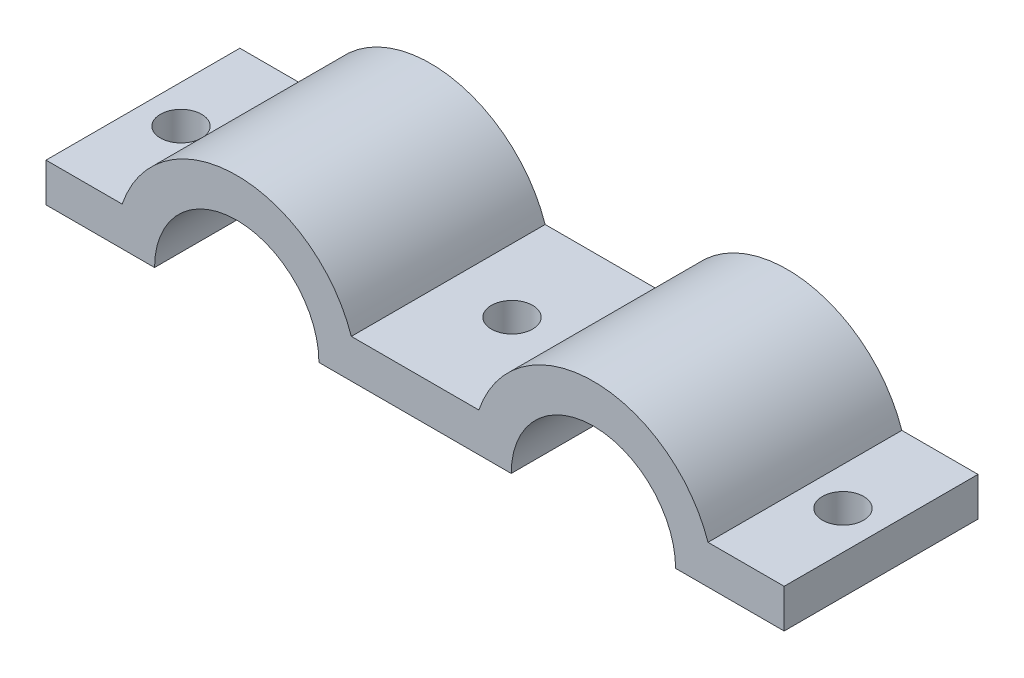
ISO-10303-21;
HEADER;
FILE_DESCRIPTION(('STEP AP214'),'2;1');
FILE_NAME('part.step','',(''),(''),'','','');
FILE_SCHEMA(('AUTOMOTIVE_DESIGN { 1 0 10303 214 1 1 1 1 }'));
ENDSEC;
DATA;
#1=APPLICATION_CONTEXT('core data for automotive mechanical design processes');
#2=APPLICATION_PROTOCOL_DEFINITION('international standard','automotive_design',2000,#1);
#3=PRODUCT_CONTEXT('',#1,'mechanical');
#4=PRODUCT('Part','Part','',(#3));
#5=PRODUCT_RELATED_PRODUCT_CATEGORY('part','',(#4));
#6=PRODUCT_DEFINITION_FORMATION('','',#4);
#7=PRODUCT_DEFINITION_CONTEXT('part definition',#1,'design');
#8=PRODUCT_DEFINITION('design','',#6,#7);
#9=PRODUCT_DEFINITION_SHAPE('','',#8);
#10=(LENGTH_UNIT() NAMED_UNIT(*) SI_UNIT(.MILLI.,.METRE.));
#11=(NAMED_UNIT(*) PLANE_ANGLE_UNIT() SI_UNIT($,.RADIAN.));
#12=(NAMED_UNIT(*) SI_UNIT($,.STERADIAN.) SOLID_ANGLE_UNIT());
#13=UNCERTAINTY_MEASURE_WITH_UNIT(LENGTH_MEASURE(1.E-05),#10,'distance_accuracy_value','');
#14=(GEOMETRIC_REPRESENTATION_CONTEXT(3) GLOBAL_UNCERTAINTY_ASSIGNED_CONTEXT((#13)) GLOBAL_UNIT_ASSIGNED_CONTEXT((#10,
#11,#12)) REPRESENTATION_CONTEXT('',''));
#15=CARTESIAN_POINT('',(0.,0.,0.));
#16=DIRECTION('',(0.,0.,1.));
#17=DIRECTION('',(1.,0.,0.));
#18=AXIS2_PLACEMENT_3D('',#15,#16,#17);
#19=CARTESIAN_POINT('',(31.242,-2.20309881449055E-13,31.75));
#20=DIRECTION('',(0.,0.,-1.));
#21=DIRECTION('',(-1.,0.,0.));
#22=AXIS2_PLACEMENT_3D('',#19,#20,#21);
#23=CYLINDRICAL_SURFACE('',#22,19.8120000001747);
#24=CARTESIAN_POINT('',(31.242,-2.20309881449055E-13,0.));
#25=DIRECTION('',(0.,0.,1.));
#26=DIRECTION('',(-1.,0.,0.));
#27=AXIS2_PLACEMENT_3D('',#24,#25,#26);
#28=CIRCLE('',#27,19.8120000001747);
#29=CARTESIAN_POINT('',(50.0088016456433,6.35,0.));
#30=VERTEX_POINT('',#29);
#31=CARTESIAN_POINT('',(12.4751983543567,6.35,0.));
#32=VERTEX_POINT('',#31);
#33=EDGE_CURVE('E157',#30,#32,#28,.T.);
#34=ORIENTED_EDGE('',*,*,#33,.T.);
#35=DIRECTION('',(0.,0.,-1.));
#36=VECTOR('',#35,1.);
#37=CARTESIAN_POINT('',(12.4751983543567,6.35,31.75));
#38=LINE('',#37,#36);
#39=CARTESIAN_POINT('',(12.4751983543567,6.35,31.75));
#40=VERTEX_POINT('',#39);
#41=EDGE_CURVE('E11',#40,#32,#38,.T.);
#42=ORIENTED_EDGE('',*,*,#41,.F.);
#43=CARTESIAN_POINT('',(31.242,-2.20309881449055E-13,31.75));
#44=DIRECTION('',(0.,0.,1.));
#45=DIRECTION('',(-1.,0.,0.));
#46=AXIS2_PLACEMENT_3D('',#43,#44,#45);
#47=CIRCLE('',#46,19.8120000001747);
#48=CARTESIAN_POINT('',(50.0088016456433,6.35,31.75));
#49=VERTEX_POINT('',#48);
#50=EDGE_CURVE('E180',#49,#40,#47,.T.);
#51=ORIENTED_EDGE('',*,*,#50,.F.);
#52=DIRECTION('',(0.,0.,-1.));
#53=VECTOR('',#52,1.);
#54=CARTESIAN_POINT('',(50.0088016456433,6.35,31.75));
#55=LINE('',#54,#53);
#56=EDGE_CURVE('E153',#49,#30,#55,.T.);
#57=ORIENTED_EDGE('',*,*,#56,.T.);
#58=EDGE_LOOP('',(#34,#42,#51,#57));
#59=FACE_BOUND('',#58,.T.);
#60=ADVANCED_FACE('F37',(#59),#23,.T.);
#61=CARTESIAN_POINT('',(12.4751983543567,6.35,31.75));
#62=DIRECTION('',(0.,-1.,0.));
#63=DIRECTION('',(1.,0.,0.));
#64=AXIS2_PLACEMENT_3D('',#61,#62,#63);
#65=PLANE('',#64);
#66=CARTESIAN_POINT('',(6.23759917717834,6.35,15.875));
#67=DIRECTION('',(0.,1.,0.));
#68=DIRECTION('',(-1.,0.,0.));
#69=AXIS2_PLACEMENT_3D('',#66,#67,#68);
#70=CIRCLE('',#69,3.37819999999999);
#71=CARTESIAN_POINT('',(2.85939917717835,6.35,15.875));
#72=VERTEX_POINT('',#71);
#73=EDGE_CURVE('E301',#72,#72,#70,.T.);
#74=ORIENTED_EDGE('',*,*,#73,.F.);
#75=EDGE_LOOP('',(#74));
#76=FACE_BOUND('',#75,.T.);
#77=DIRECTION('',(-1.,0.,0.));
#78=VECTOR('',#77,1.);
#79=CARTESIAN_POINT('',(12.4751983543567,6.35,0.));
#80=LINE('',#79,#78);
#81=CARTESIAN_POINT('',(0.,6.35,0.));
#82=VERTEX_POINT('',#81);
#83=EDGE_CURVE('E160',#32,#82,#80,.T.);
#84=ORIENTED_EDGE('',*,*,#83,.T.);
#85=DIRECTION('',(0.,0.,-1.));
#86=VECTOR('',#85,1.);
#87=CARTESIAN_POINT('',(0.,6.35,31.75));
#88=LINE('',#87,#86);
#89=CARTESIAN_POINT('',(0.,6.35,31.75));
#90=VERTEX_POINT('',#89);
#91=EDGE_CURVE('E45',#90,#82,#88,.T.);
#92=ORIENTED_EDGE('',*,*,#91,.F.);
#93=DIRECTION('',(-1.,0.,0.));
#94=VECTOR('',#93,1.);
#95=CARTESIAN_POINT('',(12.4751983543567,6.35,31.75));
#96=LINE('',#95,#94);
#97=EDGE_CURVE('E108',#40,#90,#96,.T.);
#98=ORIENTED_EDGE('',*,*,#97,.F.);
#99=ORIENTED_EDGE('',*,*,#41,.T.);
#100=EDGE_LOOP('',(#84,#92,#98,#99));
#101=FACE_BOUND('',#100,.T.);
#102=ADVANCED_FACE('F260',(#76,#101),#65,.F.);
#103=CARTESIAN_POINT('',(0.,6.35,31.75));
#104=DIRECTION('',(1.,0.,0.));
#105=DIRECTION('',(0.,1.,0.));
#106=AXIS2_PLACEMENT_3D('',#103,#104,#105);
#107=PLANE('',#106);
#108=DIRECTION('',(0.,-1.,0.));
#109=VECTOR('',#108,1.);
#110=CARTESIAN_POINT('',(0.,6.35,0.));
#111=LINE('',#110,#109);
#112=CARTESIAN_POINT('',(0.,0.,0.));
#113=VERTEX_POINT('',#112);
#114=EDGE_CURVE('E163',#82,#113,#111,.T.);
#115=ORIENTED_EDGE('',*,*,#114,.T.);
#116=DIRECTION('',(0.,0.,-1.));
#117=VECTOR('',#116,1.);
#118=CARTESIAN_POINT('',(0.,0.,31.75));
#119=LINE('',#118,#117);
#120=CARTESIAN_POINT('',(0.,0.,31.75));
#121=VERTEX_POINT('',#120);
#122=EDGE_CURVE('E199',#121,#113,#119,.T.);
#123=ORIENTED_EDGE('',*,*,#122,.F.);
#124=DIRECTION('',(0.,-1.,0.));
#125=VECTOR('',#124,1.);
#126=CARTESIAN_POINT('',(0.,6.35,31.75));
#127=LINE('',#126,#125);
#128=EDGE_CURVE('E207',#90,#121,#127,.T.);
#129=ORIENTED_EDGE('',*,*,#128,.F.);
#130=ORIENTED_EDGE('',*,*,#91,.T.);
#131=EDGE_LOOP('',(#115,#123,#129,#130));
#132=FACE_BOUND('',#131,.T.);
#133=ADVANCED_FACE('F205',(#132),#107,.F.);
#134=CARTESIAN_POINT('',(0.,0.,31.75));
#135=DIRECTION('',(0.,1.,0.));
#136=DIRECTION('',(0.,0.,1.));
#137=AXIS2_PLACEMENT_3D('',#134,#135,#136);
#138=PLANE('',#137);
#139=CARTESIAN_POINT('',(6.23759917717835,0.,15.875));
#140=DIRECTION('',(0.,1.,0.));
#141=DIRECTION('',(-1.,0.,0.));
#142=AXIS2_PLACEMENT_3D('',#139,#140,#141);
#143=CIRCLE('',#142,3.37819999999999);
#144=CARTESIAN_POINT('',(2.85939917717835,0.,15.875));
#145=VERTEX_POINT('',#144);
#146=EDGE_CURVE('E297',#145,#145,#143,.T.);
#147=ORIENTED_EDGE('',*,*,#146,.T.);
#148=EDGE_LOOP('',(#147));
#149=FACE_BOUND('',#148,.T.);
#150=DIRECTION('',(1.,0.,0.));
#151=VECTOR('',#150,1.);
#152=CARTESIAN_POINT('',(0.,0.,0.));
#153=LINE('',#152,#151);
#154=CARTESIAN_POINT('',(17.78,0.,0.));
#155=VERTEX_POINT('',#154);
#156=EDGE_CURVE('E165',#113,#155,#153,.T.);
#157=ORIENTED_EDGE('',*,*,#156,.T.);
#158=DIRECTION('',(0.,0.,-1.));
#159=VECTOR('',#158,1.);
#160=CARTESIAN_POINT('',(17.78,0.,31.75));
#161=LINE('',#160,#159);
#162=CARTESIAN_POINT('',(17.78,0.,31.75));
#163=VERTEX_POINT('',#162);
#164=EDGE_CURVE('E196',#163,#155,#161,.T.);
#165=ORIENTED_EDGE('',*,*,#164,.F.);
#166=DIRECTION('',(1.,0.,0.));
#167=VECTOR('',#166,1.);
#168=CARTESIAN_POINT('',(0.,0.,31.75));
#169=LINE('',#168,#167);
#170=EDGE_CURVE('E225',#121,#163,#169,.T.);
#171=ORIENTED_EDGE('',*,*,#170,.F.);
#172=ORIENTED_EDGE('',*,*,#122,.T.);
#173=EDGE_LOOP('',(#157,#165,#171,#172));
#174=FACE_BOUND('',#173,.T.);
#175=ADVANCED_FACE('F216',(#149,#174),#138,.F.);
#176=CARTESIAN_POINT('',(31.242,-2.20309881449055E-13,31.75));
#177=DIRECTION('',(0.,0.,-1.));
#178=DIRECTION('',(-1.,0.,0.));
#179=AXIS2_PLACEMENT_3D('',#176,#177,#178);
#180=CYLINDRICAL_SURFACE('',#179,13.462);
#181=CARTESIAN_POINT('',(31.242,-2.20309881449055E-13,0.));
#182=DIRECTION('',(0.,0.,-1.));
#183=DIRECTION('',(-1.,0.,0.));
#184=AXIS2_PLACEMENT_3D('',#181,#182,#183);
#185=CIRCLE('',#184,13.462);
#186=CARTESIAN_POINT('',(44.704,0.,0.));
#187=VERTEX_POINT('',#186);
#188=EDGE_CURVE('E167',#155,#187,#185,.T.);
#189=ORIENTED_EDGE('',*,*,#188,.T.);
#190=DIRECTION('',(0.,0.,-1.));
#191=VECTOR('',#190,1.);
#192=CARTESIAN_POINT('',(44.704,0.,31.75));
#193=LINE('',#192,#191);
#194=CARTESIAN_POINT('',(44.704,0.,31.75));
#195=VERTEX_POINT('',#194);
#196=EDGE_CURVE('E193',#195,#187,#193,.T.);
#197=ORIENTED_EDGE('',*,*,#196,.F.);
#198=CARTESIAN_POINT('',(31.242,-2.20309881449055E-13,31.75));
#199=DIRECTION('',(0.,0.,-1.));
#200=DIRECTION('',(-1.,0.,0.));
#201=AXIS2_PLACEMENT_3D('',#198,#199,#200);
#202=CIRCLE('',#201,13.462);
#203=EDGE_CURVE('E222',#163,#195,#202,.T.);
#204=ORIENTED_EDGE('',*,*,#203,.F.);
#205=ORIENTED_EDGE('',*,*,#164,.T.);
#206=EDGE_LOOP('',(#189,#197,#204,#205));
#207=FACE_BOUND('',#206,.T.);
#208=ADVANCED_FACE('F220',(#207),#180,.F.);
#209=CARTESIAN_POINT('',(76.2,0.,31.75));
#210=DIRECTION('',(0.,1.,0.));
#211=DIRECTION('',(-1.,0.,0.));
#212=AXIS2_PLACEMENT_3D('',#209,#210,#211);
#213=PLANE('',#212);
#214=CARTESIAN_POINT('',(60.452,0.,15.875));
#215=DIRECTION('',(0.,1.,0.));
#216=DIRECTION('',(-1.,0.,0.));
#217=AXIS2_PLACEMENT_3D('',#214,#215,#216);
#218=CIRCLE('',#217,3.37819999999998);
#219=CARTESIAN_POINT('',(57.0738,0.,15.875));
#220=VERTEX_POINT('',#219);
#221=EDGE_CURVE('E161',#220,#220,#218,.T.);
#222=ORIENTED_EDGE('',*,*,#221,.T.);
#223=EDGE_LOOP('',(#222));
#224=FACE_BOUND('',#223,.T.);
#225=DIRECTION('',(1.,0.,0.));
#226=VECTOR('',#225,1.);
#227=CARTESIAN_POINT('',(76.2,0.,0.));
#228=LINE('',#227,#226);
#229=CARTESIAN_POINT('',(76.1999999999999,0.,0.));
#230=VERTEX_POINT('',#229);
#231=EDGE_CURVE('E169',#187,#230,#228,.T.);
#232=ORIENTED_EDGE('',*,*,#231,.T.);
#233=DIRECTION('',(0.,0.,-1.));
#234=VECTOR('',#233,1.);
#235=CARTESIAN_POINT('',(76.1999999999999,0.,31.75));
#236=LINE('',#235,#234);
#237=CARTESIAN_POINT('',(76.1999999999999,0.,31.75));
#238=VERTEX_POINT('',#237);
#239=EDGE_CURVE('E190',#238,#230,#236,.T.);
#240=ORIENTED_EDGE('',*,*,#239,.F.);
#241=DIRECTION('',(1.,0.,0.));
#242=VECTOR('',#241,1.);
#243=CARTESIAN_POINT('',(76.2,0.,31.75));
#244=LINE('',#243,#242);
#245=EDGE_CURVE('E224',#195,#238,#244,.T.);
#246=ORIENTED_EDGE('',*,*,#245,.F.);
#247=ORIENTED_EDGE('',*,*,#196,.T.);
#248=EDGE_LOOP('',(#232,#240,#246,#247));
#249=FACE_BOUND('',#248,.T.);
#250=ADVANCED_FACE('F276',(#224,#249),#213,.F.);
#251=CARTESIAN_POINT('',(89.662,-2.13155494848436E-13,31.75));
#252=DIRECTION('',(0.,0.,-1.));
#253=DIRECTION('',(-1.,0.,0.));
#254=AXIS2_PLACEMENT_3D('',#251,#252,#253);
#255=CYLINDRICAL_SURFACE('',#254,13.462);
#256=CARTESIAN_POINT('',(89.662,-2.13155494848436E-13,0.));
#257=DIRECTION('',(0.,0.,-1.));
#258=DIRECTION('',(1.,0.,0.));
#259=AXIS2_PLACEMENT_3D('',#256,#257,#258);
#260=CIRCLE('',#259,13.462);
#261=CARTESIAN_POINT('',(103.124,0.,0.));
#262=VERTEX_POINT('',#261);
#263=EDGE_CURVE('E171',#230,#262,#260,.T.);
#264=ORIENTED_EDGE('',*,*,#263,.T.);
#265=DIRECTION('',(0.,0.,-1.));
#266=VECTOR('',#265,1.);
#267=CARTESIAN_POINT('',(103.124,0.,31.75));
#268=LINE('',#267,#266);
#269=CARTESIAN_POINT('',(103.124,0.,31.75));
#270=VERTEX_POINT('',#269);
#271=EDGE_CURVE('E187',#270,#262,#268,.T.);
#272=ORIENTED_EDGE('',*,*,#271,.F.);
#273=CARTESIAN_POINT('',(89.662,-2.13155494848436E-13,31.75));
#274=DIRECTION('',(0.,0.,-1.));
#275=DIRECTION('',(1.,0.,0.));
#276=AXIS2_PLACEMENT_3D('',#273,#274,#275);
#277=CIRCLE('',#276,13.462);
#278=EDGE_CURVE('E227',#238,#270,#277,.T.);
#279=ORIENTED_EDGE('',*,*,#278,.F.);
#280=ORIENTED_EDGE('',*,*,#239,.T.);
#281=EDGE_LOOP('',(#264,#272,#279,#280));
#282=FACE_BOUND('',#281,.T.);
#283=ADVANCED_FACE('F279',(#282),#255,.F.);
#284=CARTESIAN_POINT('',(120.904,0.,31.75));
#285=DIRECTION('',(0.,1.,0.));
#286=DIRECTION('',(-1.,0.,0.));
#287=AXIS2_PLACEMENT_3D('',#284,#285,#286);
#288=PLANE('',#287);
#289=CARTESIAN_POINT('',(114.666400822822,0.,15.875));
#290=DIRECTION('',(0.,-1.,0.));
#291=DIRECTION('',(1.,0.,0.));
#292=AXIS2_PLACEMENT_3D('',#289,#290,#291);
#293=CIRCLE('',#292,3.37819999999999);
#294=CARTESIAN_POINT('',(118.044600822822,0.,15.875));
#295=VERTEX_POINT('',#294);
#296=EDGE_CURVE('E298',#295,#295,#293,.T.);
#297=ORIENTED_EDGE('',*,*,#296,.F.);
#298=EDGE_LOOP('',(#297));
#299=FACE_BOUND('',#298,.T.);
#300=DIRECTION('',(1.,0.,0.));
#301=VECTOR('',#300,1.);
#302=CARTESIAN_POINT('',(120.904,0.,0.));
#303=LINE('',#302,#301);
#304=CARTESIAN_POINT('',(120.904,0.,0.));
#305=VERTEX_POINT('',#304);
#306=EDGE_CURVE('E173',#262,#305,#303,.T.);
#307=ORIENTED_EDGE('',*,*,#306,.T.);
#308=DIRECTION('',(0.,0.,-1.));
#309=VECTOR('',#308,1.);
#310=CARTESIAN_POINT('',(120.904,0.,31.75));
#311=LINE('',#310,#309);
#312=CARTESIAN_POINT('',(120.904,0.,31.75));
#313=VERTEX_POINT('',#312);
#314=EDGE_CURVE('E184',#313,#305,#311,.T.);
#315=ORIENTED_EDGE('',*,*,#314,.F.);
#316=DIRECTION('',(1.,0.,0.));
#317=VECTOR('',#316,1.);
#318=CARTESIAN_POINT('',(120.904,0.,31.75));
#319=LINE('',#318,#317);
#320=EDGE_CURVE('E233',#270,#313,#319,.T.);
#321=ORIENTED_EDGE('',*,*,#320,.F.);
#322=ORIENTED_EDGE('',*,*,#271,.T.);
#323=EDGE_LOOP('',(#307,#315,#321,#322));
#324=FACE_BOUND('',#323,.T.);
#325=ADVANCED_FACE('F239',(#299,#324),#288,.F.);
#326=CARTESIAN_POINT('',(120.904,6.35000000000001,31.75));
#327=DIRECTION('',(-1.,0.,0.));
#328=DIRECTION('',(0.,-1.,0.));
#329=AXIS2_PLACEMENT_3D('',#326,#327,#328);
#330=PLANE('',#329);
#331=DIRECTION('',(0.,1.,0.));
#332=VECTOR('',#331,1.);
#333=CARTESIAN_POINT('',(120.904,6.35000000000001,0.));
#334=LINE('',#333,#332);
#335=CARTESIAN_POINT('',(120.904,6.35000000000001,0.));
#336=VERTEX_POINT('',#335);
#337=EDGE_CURVE('E175',#305,#336,#334,.T.);
#338=ORIENTED_EDGE('',*,*,#337,.T.);
#339=DIRECTION('',(0.,0.,-1.));
#340=VECTOR('',#339,1.);
#341=CARTESIAN_POINT('',(120.904,6.35000000000001,31.75));
#342=LINE('',#341,#340);
#343=CARTESIAN_POINT('',(120.904,6.35000000000001,31.75));
#344=VERTEX_POINT('',#343);
#345=EDGE_CURVE('E148',#344,#336,#342,.T.);
#346=ORIENTED_EDGE('',*,*,#345,.F.);
#347=DIRECTION('',(0.,1.,0.));
#348=VECTOR('',#347,1.);
#349=CARTESIAN_POINT('',(120.904,6.35000000000001,31.75));
#350=LINE('',#349,#348);
#351=EDGE_CURVE('E139',#313,#344,#350,.T.);
#352=ORIENTED_EDGE('',*,*,#351,.F.);
#353=ORIENTED_EDGE('',*,*,#314,.T.);
#354=EDGE_LOOP('',(#338,#346,#352,#353));
#355=FACE_BOUND('',#354,.T.);
#356=ADVANCED_FACE('F243',(#355),#330,.F.);
#357=CARTESIAN_POINT('',(108.428801645643,6.35000000000001,31.75));
#358=DIRECTION('',(0.,-1.,0.));
#359=DIRECTION('',(1.,0.,0.));
#360=AXIS2_PLACEMENT_3D('',#357,#358,#359);
#361=PLANE('',#360);
#362=CARTESIAN_POINT('',(114.666400822822,6.35000000000001,15.875));
#363=DIRECTION('',(0.,-1.,0.));
#364=DIRECTION('',(1.,0.,0.));
#365=AXIS2_PLACEMENT_3D('',#362,#363,#364);
#366=CIRCLE('',#365,3.37819999999999);
#367=CARTESIAN_POINT('',(118.044600822822,6.35000000000002,15.875));
#368=VERTEX_POINT('',#367);
#369=EDGE_CURVE('E295',#368,#368,#366,.T.);
#370=ORIENTED_EDGE('',*,*,#369,.T.);
#371=EDGE_LOOP('',(#370));
#372=FACE_BOUND('',#371,.T.);
#373=DIRECTION('',(-1.,0.,0.));
#374=VECTOR('',#373,1.);
#375=CARTESIAN_POINT('',(108.428801645643,6.35000000000001,0.));
#376=LINE('',#375,#374);
#377=CARTESIAN_POINT('',(108.428801645643,6.35000000000001,0.));
#378=VERTEX_POINT('',#377);
#379=EDGE_CURVE('E147',#336,#378,#376,.T.);
#380=ORIENTED_EDGE('',*,*,#379,.T.);
#381=DIRECTION('',(0.,0.,-1.));
#382=VECTOR('',#381,1.);
#383=CARTESIAN_POINT('',(108.428801645643,6.35000000000001,31.75));
#384=LINE('',#383,#382);
#385=CARTESIAN_POINT('',(108.428801645643,6.35000000000001,31.75));
#386=VERTEX_POINT('',#385);
#387=EDGE_CURVE('E144',#386,#378,#384,.T.);
#388=ORIENTED_EDGE('',*,*,#387,.F.);
#389=DIRECTION('',(-1.,0.,0.));
#390=VECTOR('',#389,1.);
#391=CARTESIAN_POINT('',(108.428801645643,6.35000000000001,31.75));
#392=LINE('',#391,#390);
#393=EDGE_CURVE('E133',#344,#386,#392,.T.);
#394=ORIENTED_EDGE('',*,*,#393,.F.);
#395=ORIENTED_EDGE('',*,*,#345,.T.);
#396=EDGE_LOOP('',(#380,#388,#394,#395));
#397=FACE_BOUND('',#396,.T.);
#398=ADVANCED_FACE('F145',(#372,#397),#361,.F.);
#399=CARTESIAN_POINT('',(89.662,-2.13155494848436E-13,31.75));
#400=DIRECTION('',(0.,0.,-1.));
#401=DIRECTION('',(-1.,0.,0.));
#402=AXIS2_PLACEMENT_3D('',#399,#400,#401);
#403=CYLINDRICAL_SURFACE('',#402,19.8120000001747);
#404=CARTESIAN_POINT('',(89.662,-2.13155494848436E-13,0.));
#405=DIRECTION('',(0.,0.,1.));
#406=DIRECTION('',(1.,0.,0.));
#407=AXIS2_PLACEMENT_3D('',#404,#405,#406);
#408=CIRCLE('',#407,19.8120000001747);
#409=CARTESIAN_POINT('',(70.8951983543567,6.35,0.));
#410=VERTEX_POINT('',#409);
#411=EDGE_CURVE('E94',#378,#410,#408,.T.);
#412=ORIENTED_EDGE('',*,*,#411,.T.);
#413=DIRECTION('',(0.,0.,-1.));
#414=VECTOR('',#413,1.);
#415=CARTESIAN_POINT('',(70.8951983543567,6.35,31.75));
#416=LINE('',#415,#414);
#417=CARTESIAN_POINT('',(70.8951983543567,6.35,31.75));
#418=VERTEX_POINT('',#417);
#419=EDGE_CURVE('E149',#418,#410,#416,.T.);
#420=ORIENTED_EDGE('',*,*,#419,.F.);
#421=CARTESIAN_POINT('',(89.662,-2.13155494848436E-13,31.75));
#422=DIRECTION('',(0.,0.,1.));
#423=DIRECTION('',(1.,0.,0.));
#424=AXIS2_PLACEMENT_3D('',#421,#422,#423);
#425=CIRCLE('',#424,19.8120000001747);
#426=EDGE_CURVE('E137',#386,#418,#425,.T.);
#427=ORIENTED_EDGE('',*,*,#426,.F.);
#428=ORIENTED_EDGE('',*,*,#387,.T.);
#429=EDGE_LOOP('',(#412,#420,#427,#428));
#430=FACE_BOUND('',#429,.T.);
#431=ADVANCED_FACE('F151',(#430),#403,.T.);
#432=CARTESIAN_POINT('',(50.0088016456433,6.35,31.75));
#433=DIRECTION('',(0.,-1.,0.));
#434=DIRECTION('',(1.,0.,0.));
#435=AXIS2_PLACEMENT_3D('',#432,#433,#434);
#436=PLANE('',#435);
#437=CARTESIAN_POINT('',(60.452,6.35000000000001,15.875));
#438=DIRECTION('',(0.,1.,0.));
#439=DIRECTION('',(-1.,0.,0.));
#440=AXIS2_PLACEMENT_3D('',#437,#438,#439);
#441=CIRCLE('',#440,3.37819999999998);
#442=CARTESIAN_POINT('',(57.0738,6.35000000000001,15.875));
#443=VERTEX_POINT('',#442);
#444=EDGE_CURVE('E309',#443,#443,#441,.T.);
#445=ORIENTED_EDGE('',*,*,#444,.F.);
#446=EDGE_LOOP('',(#445));
#447=FACE_BOUND('',#446,.T.);
#448=DIRECTION('',(-1.,0.,0.));
#449=VECTOR('',#448,1.);
#450=CARTESIAN_POINT('',(50.0088016456433,6.35,0.));
#451=LINE('',#450,#449);
#452=EDGE_CURVE('E100',#410,#30,#451,.T.);
#453=ORIENTED_EDGE('',*,*,#452,.T.);
#454=ORIENTED_EDGE('',*,*,#56,.F.);
#455=DIRECTION('',(-1.,0.,0.));
#456=VECTOR('',#455,1.);
#457=CARTESIAN_POINT('',(50.0088016456433,6.35,31.75));
#458=LINE('',#457,#456);
#459=EDGE_CURVE('E53',#418,#49,#458,.T.);
#460=ORIENTED_EDGE('',*,*,#459,.F.);
#461=ORIENTED_EDGE('',*,*,#419,.T.);
#462=EDGE_LOOP('',(#453,#454,#460,#461));
#463=FACE_BOUND('',#462,.T.);
#464=ADVANCED_FACE('F247',(#447,#463),#436,.F.);
#465=CARTESIAN_POINT('',(31.242,-2.20309881449055E-13,31.75));
#466=DIRECTION('',(0.,0.,-1.));
#467=DIRECTION('',(-1.,0.,0.));
#468=AXIS2_PLACEMENT_3D('',#465,#466,#467);
#469=PLANE('',#468);
#470=ORIENTED_EDGE('',*,*,#50,.T.);
#471=ORIENTED_EDGE('',*,*,#97,.T.);
#472=ORIENTED_EDGE('',*,*,#128,.T.);
#473=ORIENTED_EDGE('',*,*,#170,.T.);
#474=ORIENTED_EDGE('',*,*,#203,.T.);
#475=ORIENTED_EDGE('',*,*,#245,.T.);
#476=ORIENTED_EDGE('',*,*,#278,.T.);
#477=ORIENTED_EDGE('',*,*,#320,.T.);
#478=ORIENTED_EDGE('',*,*,#351,.T.);
#479=ORIENTED_EDGE('',*,*,#393,.T.);
#480=ORIENTED_EDGE('',*,*,#426,.T.);
#481=ORIENTED_EDGE('',*,*,#459,.T.);
#482=EDGE_LOOP('',(#470,#471,#472,#473,#474,#475,#476,#477,#478,#479,#480,#481));
#483=FACE_BOUND('',#482,.T.);
#484=ADVANCED_FACE('F135',(#483),#469,.F.);
#485=CARTESIAN_POINT('',(31.242,-2.20309881449055E-13,0.));
#486=DIRECTION('',(0.,0.,-1.));
#487=DIRECTION('',(-1.,0.,0.));
#488=AXIS2_PLACEMENT_3D('',#485,#486,#487);
#489=PLANE('',#488);
#490=ORIENTED_EDGE('',*,*,#33,.F.);
#491=ORIENTED_EDGE('',*,*,#452,.F.);
#492=ORIENTED_EDGE('',*,*,#411,.F.);
#493=ORIENTED_EDGE('',*,*,#379,.F.);
#494=ORIENTED_EDGE('',*,*,#337,.F.);
#495=ORIENTED_EDGE('',*,*,#306,.F.);
#496=ORIENTED_EDGE('',*,*,#263,.F.);
#497=ORIENTED_EDGE('',*,*,#231,.F.);
#498=ORIENTED_EDGE('',*,*,#188,.F.);
#499=ORIENTED_EDGE('',*,*,#156,.F.);
#500=ORIENTED_EDGE('',*,*,#114,.F.);
#501=ORIENTED_EDGE('',*,*,#83,.F.);
#502=EDGE_LOOP('',(#490,#491,#492,#493,#494,#495,#496,#497,#498,#499,#500,#501));
#503=FACE_BOUND('',#502,.T.);
#504=ADVANCED_FACE('F211',(#503),#489,.T.);
#505=CARTESIAN_POINT('',(60.452,0.,15.875));
#506=DIRECTION('',(0.,1.,0.));
#507=DIRECTION('',(-1.,0.,0.));
#508=AXIS2_PLACEMENT_3D('',#505,#506,#507);
#509=CYLINDRICAL_SURFACE('',#508,3.37819999999998);
#510=ORIENTED_EDGE('',*,*,#221,.F.);
#511=EDGE_LOOP('',(#510));
#512=FACE_BOUND('',#511,.T.);
#513=ORIENTED_EDGE('',*,*,#444,.T.);
#514=EDGE_LOOP('',(#513));
#515=FACE_BOUND('',#514,.T.);
#516=ADVANCED_FACE('F324',(#512,#515),#509,.F.);
#517=CARTESIAN_POINT('',(114.666400822822,0.,15.875));
#518=DIRECTION('',(0.,1.,0.));
#519=DIRECTION('',(-1.,0.,0.));
#520=AXIS2_PLACEMENT_3D('',#517,#518,#519);
#521=CYLINDRICAL_SURFACE('',#520,3.37819999999999);
#522=ORIENTED_EDGE('',*,*,#296,.T.);
#523=EDGE_LOOP('',(#522));
#524=FACE_BOUND('',#523,.T.);
#525=ORIENTED_EDGE('',*,*,#369,.F.);
#526=EDGE_LOOP('',(#525));
#527=FACE_BOUND('',#526,.T.);
#528=ADVANCED_FACE('F318',(#524,#527),#521,.F.);
#529=CARTESIAN_POINT('',(6.23759917717835,0.,15.875));
#530=DIRECTION('',(0.,1.,0.));
#531=DIRECTION('',(-1.,0.,0.));
#532=AXIS2_PLACEMENT_3D('',#529,#530,#531);
#533=CYLINDRICAL_SURFACE('',#532,3.37819999999999);
#534=ORIENTED_EDGE('',*,*,#146,.F.);
#535=EDGE_LOOP('',(#534));
#536=FACE_BOUND('',#535,.T.);
#537=ORIENTED_EDGE('',*,*,#73,.T.);
#538=EDGE_LOOP('',(#537));
#539=FACE_BOUND('',#538,.T.);
#540=ADVANCED_FACE('F316',(#536,#539),#533,.F.);
#541=CLOSED_SHELL('',(#60,#102,#133,#175,#208,#250,#283,#325,#356,#398,#431,#464,#484,#504,#516,
#528,#540));
#542=MANIFOLD_SOLID_BREP('B2',#541);
#543=ADVANCED_BREP_SHAPE_REPRESENTATION('',(#18,#542),#14);
#544=SHAPE_DEFINITION_REPRESENTATION(#9,#543);
ENDSEC;
END-ISO-10303-21;
